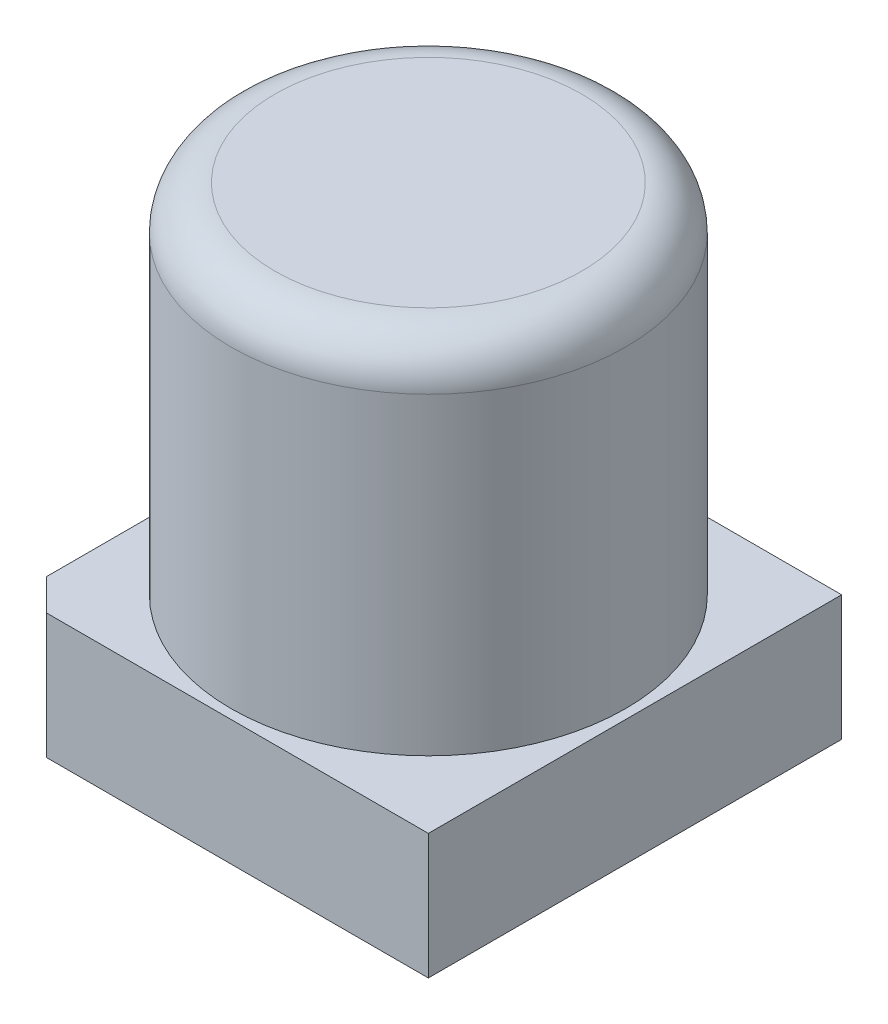
ISO-10303-21;
HEADER;
FILE_DESCRIPTION(('STEP AP214'),'2;1');
FILE_NAME('part.step','',(''),(''),'','','');
FILE_SCHEMA(('AUTOMOTIVE_DESIGN { 1 0 10303 214 1 1 1 1 }'));
ENDSEC;
DATA;
#1=APPLICATION_CONTEXT('core data for automotive mechanical design processes');
#2=APPLICATION_PROTOCOL_DEFINITION('international standard','automotive_design',2000,#1);
#3=PRODUCT_CONTEXT('',#1,'mechanical');
#4=PRODUCT('Part','Part','',(#3));
#5=PRODUCT_RELATED_PRODUCT_CATEGORY('part','',(#4));
#6=PRODUCT_DEFINITION_FORMATION('','',#4);
#7=PRODUCT_DEFINITION_CONTEXT('part definition',#1,'design');
#8=PRODUCT_DEFINITION('design','',#6,#7);
#9=PRODUCT_DEFINITION_SHAPE('','',#8);
#10=(LENGTH_UNIT() NAMED_UNIT(*) SI_UNIT(.MILLI.,.METRE.));
#11=(NAMED_UNIT(*) PLANE_ANGLE_UNIT() SI_UNIT($,.RADIAN.));
#12=(NAMED_UNIT(*) SI_UNIT($,.STERADIAN.) SOLID_ANGLE_UNIT());
#13=UNCERTAINTY_MEASURE_WITH_UNIT(LENGTH_MEASURE(1.E-05),#10,'distance_accuracy_value','');
#14=(GEOMETRIC_REPRESENTATION_CONTEXT(3) GLOBAL_UNCERTAINTY_ASSIGNED_CONTEXT((#13)) GLOBAL_UNIT_ASSIGNED_CONTEXT((#10,
#11,#12)) REPRESENTATION_CONTEXT('',''));
#15=CARTESIAN_POINT('',(0.,0.,0.));
#16=DIRECTION('',(0.,0.,1.));
#17=DIRECTION('',(1.,0.,0.));
#18=AXIS2_PLACEMENT_3D('',#15,#16,#17);
#19=CARTESIAN_POINT('',(6.39949,17.15,-32.151));
#20=DIRECTION('',(0.,1.,0.));
#21=DIRECTION('',(0.,0.,-1.));
#22=AXIS2_PLACEMENT_3D('',#19,#20,#21);
#23=PLANE('',#22);
#24=CARTESIAN_POINT('',(3.9,17.15,-34.65));
#25=DIRECTION('',(0.,-1.,0.));
#26=DIRECTION('',(-3.75797748928899E-13,0.,1.));
#27=AXIS2_PLACEMENT_3D('',#24,#25,#26);
#28=CIRCLE('',#27,2.44999999999704);
#29=CARTESIAN_POINT('',(3.89999999999986,17.15,-37.0999999999982));
#30=VERTEX_POINT('',#29);
#31=CARTESIAN_POINT('',(3.89999999999945,17.15,-32.2000000000018));
#32=VERTEX_POINT('',#31);
#33=EDGE_CURVE('E113',#30,#32,#28,.F.);
#34=ORIENTED_EDGE('',*,*,#33,.T.);
#35=CARTESIAN_POINT('',(3.9,17.15,-34.65));
#36=DIRECTION('',(0.,-1.,0.));
#37=DIRECTION('',(-3.32960699828197E-13,0.,-1.));
#38=AXIS2_PLACEMENT_3D('',#35,#36,#37);
#39=CIRCLE('',#38,2.44999999999703);
#40=EDGE_CURVE('E116',#32,#30,#39,.F.);
#41=ORIENTED_EDGE('',*,*,#40,.T.);
#42=EDGE_LOOP('',(#34,#41));
#43=FACE_BOUND('',#42,.T.);
#44=ADVANCED_FACE('F17',(#43),#23,.T.);
#45=CARTESIAN_POINT('',(3.9,16.45,-34.65));
#46=DIRECTION('',(0.,1.,0.));
#47=DIRECTION('',(-0.00590637320245588,0.,0.999982557225671));
#48=AXIS2_PLACEMENT_3D('',#45,#46,#47);
#49=TOROIDAL_SURFACE('',#48,2.4499999999971,0.7);
#50=CARTESIAN_POINT('',(3.9,16.45,-34.65));
#51=DIRECTION('',(0.,1.,0.));
#52=DIRECTION('',(0.,0.,-1.));
#53=AXIS2_PLACEMENT_3D('',#50,#51,#52);
#54=CIRCLE('',#53,3.15000000000001);
#55=CARTESIAN_POINT('',(3.9,16.45,-37.8));
#56=VERTEX_POINT('',#55);
#57=EDGE_CURVE('E121',#56,#56,#54,.T.);
#58=ORIENTED_EDGE('',*,*,#57,.T.);
#59=EDGE_LOOP('',(#58));
#60=FACE_BOUND('',#59,.T.);
#61=ORIENTED_EDGE('',*,*,#33,.F.);
#62=ORIENTED_EDGE('',*,*,#40,.F.);
#63=EDGE_LOOP('',(#61,#62));
#64=FACE_BOUND('',#63,.T.);
#65=ADVANCED_FACE('F115',(#60,#64),#49,.T.);
#66=CARTESIAN_POINT('',(3.9,11.45,-34.65));
#67=DIRECTION('',(0.,1.,0.));
#68=DIRECTION('',(0.,0.,1.));
#69=AXIS2_PLACEMENT_3D('',#66,#67,#68);
#70=CYLINDRICAL_SURFACE('',#69,3.15000000000001);
#71=CARTESIAN_POINT('',(3.9,11.45,-34.65));
#72=DIRECTION('',(0.,1.,0.));
#73=DIRECTION('',(0.,0.,1.));
#74=AXIS2_PLACEMENT_3D('',#71,#72,#73);
#75=CIRCLE('',#74,3.15000000000001);
#76=CARTESIAN_POINT('',(3.9,11.45,-31.5));
#77=VERTEX_POINT('',#76);
#78=EDGE_CURVE('E94',#77,#77,#75,.F.);
#79=ORIENTED_EDGE('',*,*,#78,.F.);
#80=EDGE_LOOP('',(#79));
#81=FACE_BOUND('',#80,.T.);
#82=ORIENTED_EDGE('',*,*,#57,.F.);
#83=EDGE_LOOP('',(#82));
#84=FACE_BOUND('',#83,.T.);
#85=ADVANCED_FACE('F142',(#81,#84),#70,.T.);
#86=CARTESIAN_POINT('',(1.1,11.45,-31.35));
#87=DIRECTION('',(-0.707106781186553,0.,0.707106781186542));
#88=DIRECTION('',(-0.707106781186542,0.,-0.707106781186553));
#89=AXIS2_PLACEMENT_3D('',#86,#87,#88);
#90=PLANE('',#89);
#91=DIRECTION('',(0.707106781186547,0.,0.707106781186547));
#92=VECTOR('',#91,1.);
#93=CARTESIAN_POINT('',(0.6,11.45,-31.85));
#94=LINE('',#93,#92);
#95=CARTESIAN_POINT('',(0.599999999999999,11.45,-31.85));
#96=VERTEX_POINT('',#95);
#97=CARTESIAN_POINT('',(1.1,11.45,-31.35));
#98=VERTEX_POINT('',#97);
#99=EDGE_CURVE('E87',#96,#98,#94,.T.);
#100=ORIENTED_EDGE('',*,*,#99,.F.);
#101=DIRECTION('',(0.,1.,0.));
#102=VECTOR('',#101,1.);
#103=CARTESIAN_POINT('',(0.6,10.45,-31.85));
#104=LINE('',#103,#102);
#105=CARTESIAN_POINT('',(0.600000000000001,9.45,-31.85));
#106=VERTEX_POINT('',#105);
#107=EDGE_CURVE('E75',#106,#96,#104,.T.);
#108=ORIENTED_EDGE('',*,*,#107,.F.);
#109=DIRECTION('',(0.707106781186542,0.,0.707106781186553));
#110=VECTOR('',#109,1.);
#111=CARTESIAN_POINT('',(0.85,9.45,-31.6));
#112=LINE('',#111,#110);
#113=CARTESIAN_POINT('',(1.1,9.45,-31.35));
#114=VERTEX_POINT('',#113);
#115=EDGE_CURVE('E95',#106,#114,#112,.T.);
#116=ORIENTED_EDGE('',*,*,#115,.T.);
#117=DIRECTION('',(0.,-1.,0.));
#118=VECTOR('',#117,1.);
#119=CARTESIAN_POINT('',(1.1,10.45,-31.35));
#120=LINE('',#119,#118);
#121=EDGE_CURVE('E90',#98,#114,#120,.T.);
#122=ORIENTED_EDGE('',*,*,#121,.F.);
#123=EDGE_LOOP('',(#100,#108,#116,#122));
#124=FACE_BOUND('',#123,.T.);
#125=ADVANCED_FACE('F88',(#124),#90,.T.);
#126=CARTESIAN_POINT('',(7.2,11.45,-31.35));
#127=DIRECTION('',(0.,1.,0.));
#128=DIRECTION('',(0.,0.,-1.));
#129=AXIS2_PLACEMENT_3D('',#126,#127,#128);
#130=PLANE('',#129);
#131=ORIENTED_EDGE('',*,*,#78,.T.);
#132=EDGE_LOOP('',(#131));
#133=FACE_BOUND('',#132,.T.);
#134=DIRECTION('',(0.707106781186547,0.,-0.707106781186548));
#135=VECTOR('',#134,1.);
#136=CARTESIAN_POINT('',(0.85,11.45,-37.7));
#137=LINE('',#136,#135);
#138=CARTESIAN_POINT('',(0.6,11.45,-37.45));
#139=VERTEX_POINT('',#138);
#140=CARTESIAN_POINT('',(1.1,11.45,-37.95));
#141=VERTEX_POINT('',#140);
#142=EDGE_CURVE('E99',#139,#141,#137,.T.);
#143=ORIENTED_EDGE('',*,*,#142,.F.);
#144=DIRECTION('',(0.,0.,-1.));
#145=VECTOR('',#144,1.);
#146=CARTESIAN_POINT('',(0.6,11.45,-34.65));
#147=LINE('',#146,#145);
#148=EDGE_CURVE('E79',#96,#139,#147,.T.);
#149=ORIENTED_EDGE('',*,*,#148,.F.);
#150=ORIENTED_EDGE('',*,*,#99,.T.);
#151=DIRECTION('',(-1.,0.,0.));
#152=VECTOR('',#151,1.);
#153=CARTESIAN_POINT('',(4.15,11.45,-31.35));
#154=LINE('',#153,#152);
#155=CARTESIAN_POINT('',(7.2,11.45,-31.35));
#156=VERTEX_POINT('',#155);
#157=EDGE_CURVE('E106',#156,#98,#154,.T.);
#158=ORIENTED_EDGE('',*,*,#157,.F.);
#159=DIRECTION('',(0.,0.,1.));
#160=VECTOR('',#159,1.);
#161=CARTESIAN_POINT('',(7.2,11.45,-34.65));
#162=LINE('',#161,#160);
#163=CARTESIAN_POINT('',(7.2,11.45,-37.95));
#164=VERTEX_POINT('',#163);
#165=EDGE_CURVE('E108',#164,#156,#162,.T.);
#166=ORIENTED_EDGE('',*,*,#165,.F.);
#167=DIRECTION('',(1.,0.,0.));
#168=VECTOR('',#167,1.);
#169=CARTESIAN_POINT('',(4.15,11.45,-37.95));
#170=LINE('',#169,#168);
#171=EDGE_CURVE('E175',#141,#164,#170,.T.);
#172=ORIENTED_EDGE('',*,*,#171,.F.);
#173=EDGE_LOOP('',(#143,#149,#150,#158,#166,#172));
#174=FACE_BOUND('',#173,.T.);
#175=ADVANCED_FACE('F97',(#133,#174),#130,.T.);
#176=CARTESIAN_POINT('',(0.6,11.45,-37.45));
#177=DIRECTION('',(-0.707106781186548,0.,-0.707106781186547));
#178=DIRECTION('',(0.707106781186547,0.,-0.707106781186548));
#179=AXIS2_PLACEMENT_3D('',#176,#177,#178);
#180=PLANE('',#179);
#181=ORIENTED_EDGE('',*,*,#142,.T.);
#182=DIRECTION('',(0.,1.,0.));
#183=VECTOR('',#182,1.);
#184=CARTESIAN_POINT('',(1.1,10.45,-37.95));
#185=LINE('',#184,#183);
#186=CARTESIAN_POINT('',(1.1,9.45,-37.95));
#187=VERTEX_POINT('',#186);
#188=EDGE_CURVE('E174',#187,#141,#185,.T.);
#189=ORIENTED_EDGE('',*,*,#188,.F.);
#190=DIRECTION('',(-0.707106781186547,0.,0.707106781186548));
#191=VECTOR('',#190,1.);
#192=CARTESIAN_POINT('',(0.85,9.45,-37.7));
#193=LINE('',#192,#191);
#194=CARTESIAN_POINT('',(0.6,9.45,-37.45));
#195=VERTEX_POINT('',#194);
#196=EDGE_CURVE('E38',#187,#195,#193,.T.);
#197=ORIENTED_EDGE('',*,*,#196,.T.);
#198=DIRECTION('',(0.,-1.,0.));
#199=VECTOR('',#198,1.);
#200=CARTESIAN_POINT('',(0.6,10.45,-37.45));
#201=LINE('',#200,#199);
#202=EDGE_CURVE('E100',#139,#195,#201,.T.);
#203=ORIENTED_EDGE('',*,*,#202,.F.);
#204=EDGE_LOOP('',(#181,#189,#197,#203));
#205=FACE_BOUND('',#204,.T.);
#206=ADVANCED_FACE('F145',(#205),#180,.T.);
#207=CARTESIAN_POINT('',(1.1,9.45,-31.35));
#208=DIRECTION('',(0.,0.,1.));
#209=DIRECTION('',(1.,0.,0.));
#210=AXIS2_PLACEMENT_3D('',#207,#208,#209);
#211=PLANE('',#210);
#212=DIRECTION('',(0.,-1.,0.));
#213=VECTOR('',#212,1.);
#214=CARTESIAN_POINT('',(7.2,10.45,-31.35));
#215=LINE('',#214,#213);
#216=CARTESIAN_POINT('',(7.2,9.45,-31.35));
#217=VERTEX_POINT('',#216);
#218=EDGE_CURVE('E176',#156,#217,#215,.T.);
#219=ORIENTED_EDGE('',*,*,#218,.F.);
#220=ORIENTED_EDGE('',*,*,#157,.T.);
#221=ORIENTED_EDGE('',*,*,#121,.T.);
#222=DIRECTION('',(1.,0.,0.));
#223=VECTOR('',#222,1.);
#224=CARTESIAN_POINT('',(3.9,9.45,-31.35));
#225=LINE('',#224,#223);
#226=EDGE_CURVE('E102',#114,#217,#225,.T.);
#227=ORIENTED_EDGE('',*,*,#226,.T.);
#228=EDGE_LOOP('',(#219,#220,#221,#227));
#229=FACE_BOUND('',#228,.T.);
#230=ADVANCED_FACE('F149',(#229),#211,.T.);
#231=CARTESIAN_POINT('',(7.2,9.45,-31.35));
#232=DIRECTION('',(1.,0.,0.));
#233=DIRECTION('',(0.,0.,-1.));
#234=AXIS2_PLACEMENT_3D('',#231,#232,#233);
#235=PLANE('',#234);
#236=ORIENTED_EDGE('',*,*,#165,.T.);
#237=ORIENTED_EDGE('',*,*,#218,.T.);
#238=DIRECTION('',(0.,0.,-1.));
#239=VECTOR('',#238,1.);
#240=CARTESIAN_POINT('',(7.2,9.45,-34.65));
#241=LINE('',#240,#239);
#242=CARTESIAN_POINT('',(7.2,9.45,-37.95));
#243=VERTEX_POINT('',#242);
#244=EDGE_CURVE('E179',#217,#243,#241,.T.);
#245=ORIENTED_EDGE('',*,*,#244,.T.);
#246=DIRECTION('',(0.,-1.,0.));
#247=VECTOR('',#246,1.);
#248=CARTESIAN_POINT('',(7.2,10.45,-37.95));
#249=LINE('',#248,#247);
#250=EDGE_CURVE('E83',#164,#243,#249,.T.);
#251=ORIENTED_EDGE('',*,*,#250,.F.);
#252=EDGE_LOOP('',(#236,#237,#245,#251));
#253=FACE_BOUND('',#252,.T.);
#254=ADVANCED_FACE('F152',(#253),#235,.T.);
#255=CARTESIAN_POINT('',(7.2,9.45,-37.95));
#256=DIRECTION('',(0.,0.,-1.));
#257=DIRECTION('',(-1.,0.,0.));
#258=AXIS2_PLACEMENT_3D('',#255,#256,#257);
#259=PLANE('',#258);
#260=ORIENTED_EDGE('',*,*,#250,.T.);
#261=DIRECTION('',(-1.,0.,0.));
#262=VECTOR('',#261,1.);
#263=CARTESIAN_POINT('',(3.9,9.45,-37.95));
#264=LINE('',#263,#262);
#265=EDGE_CURVE('E29',#243,#187,#264,.T.);
#266=ORIENTED_EDGE('',*,*,#265,.T.);
#267=ORIENTED_EDGE('',*,*,#188,.T.);
#268=ORIENTED_EDGE('',*,*,#171,.T.);
#269=EDGE_LOOP('',(#260,#266,#267,#268));
#270=FACE_BOUND('',#269,.T.);
#271=ADVANCED_FACE('F156',(#270),#259,.T.);
#272=CARTESIAN_POINT('',(0.6,9.45,-37.45));
#273=DIRECTION('',(-1.,0.,0.));
#274=DIRECTION('',(0.,0.,1.));
#275=AXIS2_PLACEMENT_3D('',#272,#273,#274);
#276=PLANE('',#275);
#277=ORIENTED_EDGE('',*,*,#202,.T.);
#278=DIRECTION('',(0.,0.,1.));
#279=VECTOR('',#278,1.);
#280=CARTESIAN_POINT('',(0.6,9.45,-34.65));
#281=LINE('',#280,#279);
#282=EDGE_CURVE('E11',#195,#106,#281,.T.);
#283=ORIENTED_EDGE('',*,*,#282,.T.);
#284=ORIENTED_EDGE('',*,*,#107,.T.);
#285=ORIENTED_EDGE('',*,*,#148,.T.);
#286=EDGE_LOOP('',(#277,#283,#284,#285));
#287=FACE_BOUND('',#286,.T.);
#288=ADVANCED_FACE('F77',(#287),#276,.T.);
#289=CARTESIAN_POINT('',(7.2,9.45,-31.35));
#290=DIRECTION('',(0.,1.,0.));
#291=DIRECTION('',(0.,0.,-1.));
#292=AXIS2_PLACEMENT_3D('',#289,#290,#291);
#293=PLANE('',#292);
#294=ORIENTED_EDGE('',*,*,#196,.F.);
#295=ORIENTED_EDGE('',*,*,#265,.F.);
#296=ORIENTED_EDGE('',*,*,#244,.F.);
#297=ORIENTED_EDGE('',*,*,#226,.F.);
#298=ORIENTED_EDGE('',*,*,#115,.F.);
#299=ORIENTED_EDGE('',*,*,#282,.F.);
#300=EDGE_LOOP('',(#294,#295,#296,#297,#298,#299));
#301=FACE_BOUND('',#300,.T.);
#302=ADVANCED_FACE('F19',(#301),#293,.F.);
#303=CLOSED_SHELL('',(#44,#65,#85,#125,#175,#206,#230,#254,#271,#288,#302));
#304=MANIFOLD_SOLID_BREP('B1',#303);
#305=ADVANCED_BREP_SHAPE_REPRESENTATION('',(#18,#304),#14);
#306=SHAPE_DEFINITION_REPRESENTATION(#9,#305);
ENDSEC;
END-ISO-10303-21;
